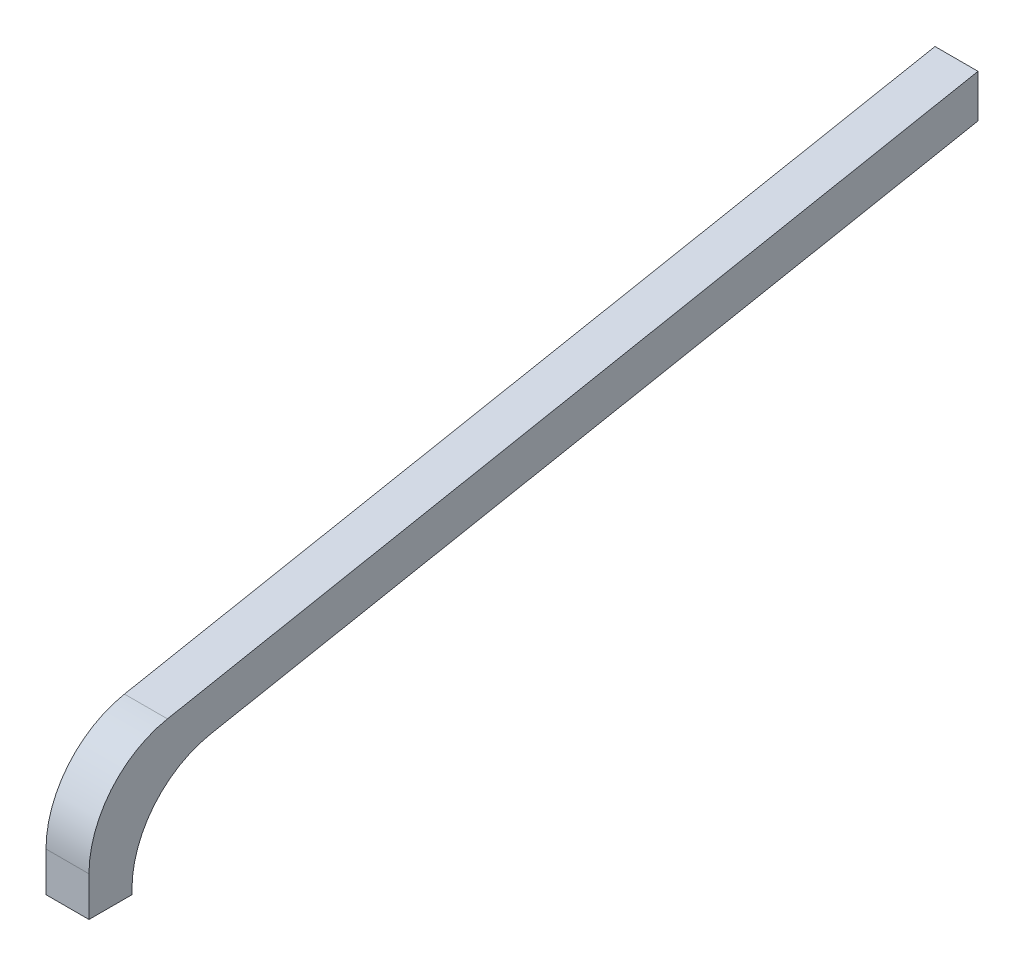
ISO-10303-21;
HEADER;
FILE_DESCRIPTION(('STEP AP214'),'2;1');
FILE_NAME('part.step','',(''),(''),'','','');
FILE_SCHEMA(('AUTOMOTIVE_DESIGN { 1 0 10303 214 1 1 1 1 }'));
ENDSEC;
DATA;
#1=APPLICATION_CONTEXT('core data for automotive mechanical design processes');
#2=APPLICATION_PROTOCOL_DEFINITION('international standard','automotive_design',2000,#1);
#3=PRODUCT_CONTEXT('',#1,'mechanical');
#4=PRODUCT('Part','Part','',(#3));
#5=PRODUCT_RELATED_PRODUCT_CATEGORY('part','',(#4));
#6=PRODUCT_DEFINITION_FORMATION('','',#4);
#7=PRODUCT_DEFINITION_CONTEXT('part definition',#1,'design');
#8=PRODUCT_DEFINITION('design','',#6,#7);
#9=PRODUCT_DEFINITION_SHAPE('','',#8);
#10=(LENGTH_UNIT() NAMED_UNIT(*) SI_UNIT(.MILLI.,.METRE.));
#11=(NAMED_UNIT(*) PLANE_ANGLE_UNIT() SI_UNIT($,.RADIAN.));
#12=(NAMED_UNIT(*) SI_UNIT($,.STERADIAN.) SOLID_ANGLE_UNIT());
#13=UNCERTAINTY_MEASURE_WITH_UNIT(LENGTH_MEASURE(1.E-05),#10,'distance_accuracy_value','');
#14=(GEOMETRIC_REPRESENTATION_CONTEXT(3) GLOBAL_UNCERTAINTY_ASSIGNED_CONTEXT((#13)) GLOBAL_UNIT_ASSIGNED_CONTEXT((#10,
#11,#12)) REPRESENTATION_CONTEXT('',''));
#15=CARTESIAN_POINT('',(0.,0.,0.));
#16=DIRECTION('',(0.,0.,1.));
#17=DIRECTION('',(1.,0.,0.));
#18=AXIS2_PLACEMENT_3D('',#15,#16,#17);
#19=CARTESIAN_POINT('',(-2.76225,-3.01580115473571,-2.8055));
#20=DIRECTION('',(1.,0.,0.));
#21=DIRECTION('',(0.,0.,-1.));
#22=AXIS2_PLACEMENT_3D('',#19,#20,#21);
#23=PLANE('',#22);
#24=DIRECTION('',(0.,-0.18846469104419,0.982079966311104));
#25=VECTOR('',#24,1.);
#26=CARTESIAN_POINT('',(-2.76225,-2.3929200336889,-3.06153530895581));
#27=LINE('',#26,#25);
#28=CARTESIAN_POINT('',(-2.76225,-0.869500000000001,-11.));
#29=VERTEX_POINT('',#28);
#30=CARTESIAN_POINT('',(-2.76225,-2.3929200336889,-3.06153530895581));
#31=VERTEX_POINT('',#30);
#32=EDGE_CURVE('E96',#29,#31,#27,.T.);
#33=ORIENTED_EDGE('',*,*,#32,.T.);
#34=CARTESIAN_POINT('',(-2.76225,-3.375,-3.25));
#35=DIRECTION('',(-1.,0.,0.));
#36=DIRECTION('',(0.,0.,1.));
#37=AXIS2_PLACEMENT_3D('',#34,#35,#36);
#38=CIRCLE('',#37,1.);
#39=CARTESIAN_POINT('',(-2.76225,-3.375,-2.25));
#40=VERTEX_POINT('',#39);
#41=EDGE_CURVE('E119',#31,#40,#38,.F.);
#42=ORIENTED_EDGE('',*,*,#41,.T.);
#43=DIRECTION('',(0.,1.,0.));
#44=VECTOR('',#43,1.);
#45=CARTESIAN_POINT('',(-2.76225,-3.425,-2.25));
#46=LINE('',#45,#44);
#47=CARTESIAN_POINT('',(-2.76225,-3.425,-2.25));
#48=VERTEX_POINT('',#47);
#49=EDGE_CURVE('E124',#40,#48,#46,.F.);
#50=ORIENTED_EDGE('',*,*,#49,.T.);
#51=DIRECTION('',(0.,0.,1.));
#52=VECTOR('',#51,1.);
#53=CARTESIAN_POINT('',(-2.76225,-3.425,-1.8055));
#54=LINE('',#53,#52);
#55=CARTESIAN_POINT('',(-2.76225,-3.425,-1.8055));
#56=VERTEX_POINT('',#55);
#57=EDGE_CURVE('E133',#48,#56,#54,.T.);
#58=ORIENTED_EDGE('',*,*,#57,.T.);
#59=DIRECTION('',(0.,1.,0.));
#60=VECTOR('',#59,1.);
#61=CARTESIAN_POINT('',(-2.76225,-3.01580115473571,-1.8055));
#62=LINE('',#61,#60);
#63=CARTESIAN_POINT('',(-2.76225,-3.01580115473571,-1.8055));
#64=VERTEX_POINT('',#63);
#65=EDGE_CURVE('E141',#56,#64,#62,.T.);
#66=ORIENTED_EDGE('',*,*,#65,.T.);
#67=CARTESIAN_POINT('',(-2.76225,-3.01580115473571,-2.8055));
#68=DIRECTION('',(-1.,0.,0.));
#69=DIRECTION('',(0.,0.,1.));
#70=AXIS2_PLACEMENT_3D('',#67,#68,#69);
#71=CIRCLE('',#70,1.);
#72=CARTESIAN_POINT('',(-2.76225,-2.03372118842461,-2.61703530895581));
#73=VERTEX_POINT('',#72);
#74=EDGE_CURVE('E20',#73,#64,#71,.F.);
#75=ORIENTED_EDGE('',*,*,#74,.F.);
#76=DIRECTION('',(0.,0.18846469104419,-0.982079966311104));
#77=VECTOR('',#76,1.);
#78=CARTESIAN_POINT('',(-2.76225,-0.425000000000001,-11.));
#79=LINE('',#78,#77);
#80=CARTESIAN_POINT('',(-2.76225,-0.425000000000001,-11.));
#81=VERTEX_POINT('',#80);
#82=EDGE_CURVE('E150',#73,#81,#79,.T.);
#83=ORIENTED_EDGE('',*,*,#82,.T.);
#84=DIRECTION('',(0.,1.,0.));
#85=VECTOR('',#84,1.);
#86=CARTESIAN_POINT('',(-2.76225,-0.869500000000001,-11.));
#87=LINE('',#86,#85);
#88=EDGE_CURVE('E70',#81,#29,#87,.F.);
#89=ORIENTED_EDGE('',*,*,#88,.T.);
#90=EDGE_LOOP('',(#33,#42,#50,#58,#66,#75,#83,#89));
#91=FACE_BOUND('',#90,.T.);
#92=ADVANCED_FACE('F17',(#91),#23,.F.);
#93=CARTESIAN_POINT('',(-2.31775,-0.869500000000001,-11.));
#94=DIRECTION('',(0.,0.,1.));
#95=DIRECTION('',(1.,0.,0.));
#96=AXIS2_PLACEMENT_3D('',#93,#94,#95);
#97=PLANE('',#96);
#98=DIRECTION('',(1.,0.,0.));
#99=VECTOR('',#98,1.);
#100=CARTESIAN_POINT('',(-2.31775,-0.425000000000001,-11.));
#101=LINE('',#100,#99);
#102=CARTESIAN_POINT('',(-2.31775,-0.425000000000001,-11.));
#103=VERTEX_POINT('',#102);
#104=EDGE_CURVE('E91',#81,#103,#101,.T.);
#105=ORIENTED_EDGE('',*,*,#104,.T.);
#106=DIRECTION('',(0.,1.,0.));
#107=VECTOR('',#106,1.);
#108=CARTESIAN_POINT('',(-2.31775,-3.01580115473571,-11.));
#109=LINE('',#108,#107);
#110=CARTESIAN_POINT('',(-2.31775,-0.869500000000001,-11.));
#111=VERTEX_POINT('',#110);
#112=EDGE_CURVE('E85',#111,#103,#109,.T.);
#113=ORIENTED_EDGE('',*,*,#112,.F.);
#114=DIRECTION('',(1.,0.,0.));
#115=VECTOR('',#114,1.);
#116=CARTESIAN_POINT('',(-2.31775,-0.869500000000001,-11.));
#117=LINE('',#116,#115);
#118=EDGE_CURVE('E88',#111,#29,#117,.F.);
#119=ORIENTED_EDGE('',*,*,#118,.T.);
#120=ORIENTED_EDGE('',*,*,#88,.F.);
#121=EDGE_LOOP('',(#105,#113,#119,#120));
#122=FACE_BOUND('',#121,.T.);
#123=ADVANCED_FACE('F87',(#122),#97,.F.);
#124=CARTESIAN_POINT('',(-2.31775,-0.425000000000001,-11.));
#125=DIRECTION('',(0.,-0.982079966311104,-0.18846469104419));
#126=DIRECTION('',(0.,0.18846469104419,-0.982079966311104));
#127=AXIS2_PLACEMENT_3D('',#124,#125,#126);
#128=PLANE('',#127);
#129=DIRECTION('',(-1.,0.,0.));
#130=VECTOR('',#129,1.);
#131=CARTESIAN_POINT('',(-2.31775,-2.03372118842461,-2.61703530895581));
#132=LINE('',#131,#130);
#133=CARTESIAN_POINT('',(-2.31775,-2.03372118842461,-2.61703530895581));
#134=VERTEX_POINT('',#133);
#135=EDGE_CURVE('E146',#134,#73,#132,.T.);
#136=ORIENTED_EDGE('',*,*,#135,.F.);
#137=DIRECTION('',(0.,-0.18846469104419,0.982079966311103));
#138=VECTOR('',#137,1.);
#139=CARTESIAN_POINT('',(-2.31775,-0.425000000000001,-11.));
#140=LINE('',#139,#138);
#141=EDGE_CURVE('E95',#103,#134,#140,.T.);
#142=ORIENTED_EDGE('',*,*,#141,.F.);
#143=ORIENTED_EDGE('',*,*,#104,.F.);
#144=ORIENTED_EDGE('',*,*,#82,.F.);
#145=EDGE_LOOP('',(#136,#142,#143,#144));
#146=FACE_BOUND('',#145,.T.);
#147=ADVANCED_FACE('F190',(#146),#128,.F.);
#148=CARTESIAN_POINT('',(-2.31775,-3.01580115473571,-2.8055));
#149=DIRECTION('',(-1.,0.,0.));
#150=DIRECTION('',(0.,0.,1.));
#151=AXIS2_PLACEMENT_3D('',#148,#149,#150);
#152=CYLINDRICAL_SURFACE('',#151,1.);
#153=CARTESIAN_POINT('',(-2.31775,-3.01580115473571,-2.8055));
#154=DIRECTION('',(-1.,0.,0.));
#155=DIRECTION('',(0.,0.,1.));
#156=AXIS2_PLACEMENT_3D('',#153,#154,#155);
#157=CIRCLE('',#156,1.);
#158=CARTESIAN_POINT('',(-2.31775,-3.01580115473571,-1.8055));
#159=VERTEX_POINT('',#158);
#160=EDGE_CURVE('E116',#134,#159,#157,.F.);
#161=ORIENTED_EDGE('',*,*,#160,.F.);
#162=ORIENTED_EDGE('',*,*,#135,.T.);
#163=ORIENTED_EDGE('',*,*,#74,.T.);
#164=DIRECTION('',(-1.,0.,0.));
#165=VECTOR('',#164,1.);
#166=CARTESIAN_POINT('',(-2.31775,-3.01580115473571,-1.8055));
#167=LINE('',#166,#165);
#168=EDGE_CURVE('E144',#64,#159,#167,.F.);
#169=ORIENTED_EDGE('',*,*,#168,.T.);
#170=EDGE_LOOP('',(#161,#162,#163,#169));
#171=FACE_BOUND('',#170,.T.);
#172=ADVANCED_FACE('F169',(#171),#152,.T.);
#173=CARTESIAN_POINT('',(-2.31775,-3.01580115473571,-1.8055));
#174=DIRECTION('',(0.,0.,-1.));
#175=DIRECTION('',(-1.,0.,0.));
#176=AXIS2_PLACEMENT_3D('',#173,#174,#175);
#177=PLANE('',#176);
#178=DIRECTION('',(1.,0.,0.));
#179=VECTOR('',#178,1.);
#180=CARTESIAN_POINT('',(-2.31775,-3.425,-1.8055));
#181=LINE('',#180,#179);
#182=CARTESIAN_POINT('',(-2.31775,-3.425,-1.8055));
#183=VERTEX_POINT('',#182);
#184=EDGE_CURVE('E139',#56,#183,#181,.T.);
#185=ORIENTED_EDGE('',*,*,#184,.T.);
#186=DIRECTION('',(0.,1.,0.));
#187=VECTOR('',#186,1.);
#188=CARTESIAN_POINT('',(-2.31775,-3.01580115473571,-1.8055));
#189=LINE('',#188,#187);
#190=EDGE_CURVE('E118',#159,#183,#189,.F.);
#191=ORIENTED_EDGE('',*,*,#190,.F.);
#192=ORIENTED_EDGE('',*,*,#168,.F.);
#193=ORIENTED_EDGE('',*,*,#65,.F.);
#194=EDGE_LOOP('',(#185,#191,#192,#193));
#195=FACE_BOUND('',#194,.T.);
#196=ADVANCED_FACE('F174',(#195),#177,.F.);
#197=CARTESIAN_POINT('',(-2.31775,-3.425,-1.8055));
#198=DIRECTION('',(0.,1.,0.));
#199=DIRECTION('',(0.,0.,1.));
#200=AXIS2_PLACEMENT_3D('',#197,#198,#199);
#201=PLANE('',#200);
#202=DIRECTION('',(1.,0.,0.));
#203=VECTOR('',#202,1.);
#204=CARTESIAN_POINT('',(-2.31775,-3.425,-2.25));
#205=LINE('',#204,#203);
#206=CARTESIAN_POINT('',(-2.31775,-3.425,-2.25));
#207=VERTEX_POINT('',#206);
#208=EDGE_CURVE('E127',#48,#207,#205,.T.);
#209=ORIENTED_EDGE('',*,*,#208,.T.);
#210=DIRECTION('',(0.,0.,-1.));
#211=VECTOR('',#210,1.);
#212=CARTESIAN_POINT('',(-2.31775,-3.425,-2.8055));
#213=LINE('',#212,#211);
#214=EDGE_CURVE('E110',#183,#207,#213,.T.);
#215=ORIENTED_EDGE('',*,*,#214,.F.);
#216=ORIENTED_EDGE('',*,*,#184,.F.);
#217=ORIENTED_EDGE('',*,*,#57,.F.);
#218=EDGE_LOOP('',(#209,#215,#216,#217));
#219=FACE_BOUND('',#218,.T.);
#220=ADVANCED_FACE('F212',(#219),#201,.F.);
#221=CARTESIAN_POINT('',(-2.31775,-3.425,-2.25));
#222=DIRECTION('',(0.,0.,1.));
#223=DIRECTION('',(1.,0.,0.));
#224=AXIS2_PLACEMENT_3D('',#221,#222,#223);
#225=PLANE('',#224);
#226=DIRECTION('',(-1.,0.,0.));
#227=VECTOR('',#226,1.);
#228=CARTESIAN_POINT('',(-2.31775,-3.375,-2.25));
#229=LINE('',#228,#227);
#230=CARTESIAN_POINT('',(-2.31775,-3.375,-2.25));
#231=VERTEX_POINT('',#230);
#232=EDGE_CURVE('E121',#40,#231,#229,.F.);
#233=ORIENTED_EDGE('',*,*,#232,.T.);
#234=DIRECTION('',(0.,1.,0.));
#235=VECTOR('',#234,1.);
#236=CARTESIAN_POINT('',(-2.31775,-3.01580115473571,-2.25));
#237=LINE('',#236,#235);
#238=EDGE_CURVE('E107',#207,#231,#237,.T.);
#239=ORIENTED_EDGE('',*,*,#238,.F.);
#240=ORIENTED_EDGE('',*,*,#208,.F.);
#241=ORIENTED_EDGE('',*,*,#49,.F.);
#242=EDGE_LOOP('',(#233,#239,#240,#241));
#243=FACE_BOUND('',#242,.T.);
#244=ADVANCED_FACE('F209',(#243),#225,.F.);
#245=CARTESIAN_POINT('',(-2.31775,-3.375,-3.25));
#246=DIRECTION('',(-1.,0.,0.));
#247=DIRECTION('',(0.,0.,1.));
#248=AXIS2_PLACEMENT_3D('',#245,#246,#247);
#249=CYLINDRICAL_SURFACE('',#248,1.);
#250=DIRECTION('',(1.,0.,0.));
#251=VECTOR('',#250,1.);
#252=CARTESIAN_POINT('',(-2.31775,-2.3929200336889,-3.06153530895581));
#253=LINE('',#252,#251);
#254=CARTESIAN_POINT('',(-2.31775,-2.3929200336889,-3.06153530895581));
#255=VERTEX_POINT('',#254);
#256=EDGE_CURVE('E35',#31,#255,#253,.T.);
#257=ORIENTED_EDGE('',*,*,#256,.T.);
#258=CARTESIAN_POINT('',(-2.31775,-3.375,-3.25));
#259=DIRECTION('',(-1.,0.,0.));
#260=DIRECTION('',(0.,0.,1.));
#261=AXIS2_PLACEMENT_3D('',#258,#259,#260);
#262=CIRCLE('',#261,1.);
#263=EDGE_CURVE('E26',#231,#255,#262,.T.);
#264=ORIENTED_EDGE('',*,*,#263,.F.);
#265=ORIENTED_EDGE('',*,*,#232,.F.);
#266=ORIENTED_EDGE('',*,*,#41,.F.);
#267=EDGE_LOOP('',(#257,#264,#265,#266));
#268=FACE_BOUND('',#267,.T.);
#269=ADVANCED_FACE('F204',(#268),#249,.F.);
#270=CARTESIAN_POINT('',(-2.31775,-2.3929200336889,-3.06153530895581));
#271=DIRECTION('',(0.,0.982079966311104,0.18846469104419));
#272=DIRECTION('',(0.,-0.18846469104419,0.982079966311104));
#273=AXIS2_PLACEMENT_3D('',#270,#271,#272);
#274=PLANE('',#273);
#275=ORIENTED_EDGE('',*,*,#118,.F.);
#276=DIRECTION('',(0.,0.18846469104419,-0.982079966311103));
#277=VECTOR('',#276,1.);
#278=CARTESIAN_POINT('',(-2.31775,-2.3929200336889,-3.06153530895581));
#279=LINE('',#278,#277);
#280=EDGE_CURVE('E11',#255,#111,#279,.T.);
#281=ORIENTED_EDGE('',*,*,#280,.F.);
#282=ORIENTED_EDGE('',*,*,#256,.F.);
#283=ORIENTED_EDGE('',*,*,#32,.F.);
#284=EDGE_LOOP('',(#275,#281,#282,#283));
#285=FACE_BOUND('',#284,.T.);
#286=ADVANCED_FACE('F99',(#285),#274,.F.);
#287=CARTESIAN_POINT('',(-2.31775,-3.01580115473571,-2.8055));
#288=DIRECTION('',(1.,0.,0.));
#289=DIRECTION('',(0.,0.,-1.));
#290=AXIS2_PLACEMENT_3D('',#287,#288,#289);
#291=PLANE('',#290);
#292=ORIENTED_EDGE('',*,*,#263,.T.);
#293=ORIENTED_EDGE('',*,*,#280,.T.);
#294=ORIENTED_EDGE('',*,*,#112,.T.);
#295=ORIENTED_EDGE('',*,*,#141,.T.);
#296=ORIENTED_EDGE('',*,*,#160,.T.);
#297=ORIENTED_EDGE('',*,*,#190,.T.);
#298=ORIENTED_EDGE('',*,*,#214,.T.);
#299=ORIENTED_EDGE('',*,*,#238,.T.);
#300=EDGE_LOOP('',(#292,#293,#294,#295,#296,#297,#298,#299));
#301=FACE_BOUND('',#300,.T.);
#302=ADVANCED_FACE('F103',(#301),#291,.T.);
#303=CLOSED_SHELL('',(#92,#123,#147,#172,#196,#220,#244,#269,#286,#302));
#304=MANIFOLD_SOLID_BREP('B1',#303);
#305=ADVANCED_BREP_SHAPE_REPRESENTATION('',(#18,#304),#14);
#306=SHAPE_DEFINITION_REPRESENTATION(#9,#305);
ENDSEC;
END-ISO-10303-21;
